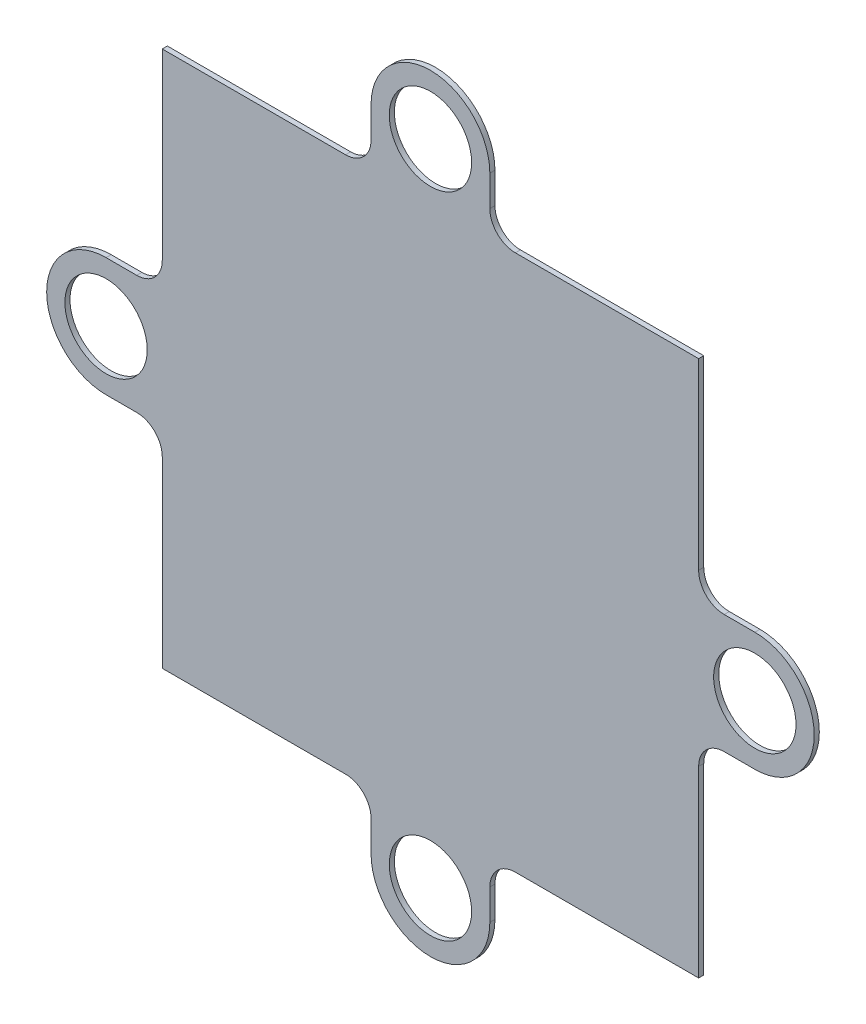
ISO-10303-21;
HEADER;
FILE_DESCRIPTION(('STEP AP214'),'2;1');
FILE_NAME('part.step','',(''),(''),'','','');
FILE_SCHEMA(('AUTOMOTIVE_DESIGN { 1 0 10303 214 1 1 1 1 }'));
ENDSEC;
DATA;
#1=APPLICATION_CONTEXT('core data for automotive mechanical design processes');
#2=APPLICATION_PROTOCOL_DEFINITION('international standard','automotive_design',2000,#1);
#3=PRODUCT_CONTEXT('',#1,'mechanical');
#4=PRODUCT('Part','Part','',(#3));
#5=PRODUCT_RELATED_PRODUCT_CATEGORY('part','',(#4));
#6=PRODUCT_DEFINITION_FORMATION('','',#4);
#7=PRODUCT_DEFINITION_CONTEXT('part definition',#1,'design');
#8=PRODUCT_DEFINITION('design','',#6,#7);
#9=PRODUCT_DEFINITION_SHAPE('','',#8);
#10=(LENGTH_UNIT() NAMED_UNIT(*) SI_UNIT(.MILLI.,.METRE.));
#11=(NAMED_UNIT(*) PLANE_ANGLE_UNIT() SI_UNIT($,.RADIAN.));
#12=(NAMED_UNIT(*) SI_UNIT($,.STERADIAN.) SOLID_ANGLE_UNIT());
#13=UNCERTAINTY_MEASURE_WITH_UNIT(LENGTH_MEASURE(1.E-05),#10,'distance_accuracy_value','');
#14=(GEOMETRIC_REPRESENTATION_CONTEXT(3) GLOBAL_UNCERTAINTY_ASSIGNED_CONTEXT((#13)) GLOBAL_UNIT_ASSIGNED_CONTEXT((#10,
#11,#12)) REPRESENTATION_CONTEXT('',''));
#15=CARTESIAN_POINT('',(0.,0.,0.));
#16=DIRECTION('',(0.,0.,1.));
#17=DIRECTION('',(1.,0.,0.));
#18=AXIS2_PLACEMENT_3D('',#15,#16,#17);
#19=CARTESIAN_POINT('',(0.,-4.64999999999974,0.4));
#20=DIRECTION('',(0.,1.,0.));
#21=DIRECTION('',(0.,0.,1.));
#22=AXIS2_PLACEMENT_3D('',#19,#20,#21);
#23=PLANE('',#22);
#24=DIRECTION('',(1.,0.,0.));
#25=VECTOR('',#24,1.);
#26=CARTESIAN_POINT('',(0.,-4.64999999999974,0.));
#27=LINE('',#26,#25);
#28=CARTESIAN_POINT('',(-25.4000000000001,-4.64999999999974,0.));
#29=VERTEX_POINT('',#28);
#30=CARTESIAN_POINT('',(-23.0000000000001,-4.64999999999974,0.));
#31=VERTEX_POINT('',#30);
#32=EDGE_CURVE('E282',#29,#31,#27,.T.);
#33=ORIENTED_EDGE('',*,*,#32,.T.);
#34=DIRECTION('',(0.,0.,-1.));
#35=VECTOR('',#34,1.);
#36=CARTESIAN_POINT('',(-23.0000000000001,-4.64999999999974,0.4));
#37=LINE('',#36,#35);
#38=CARTESIAN_POINT('',(-23.0000000000001,-4.64999999999974,0.4));
#39=VERTEX_POINT('',#38);
#40=EDGE_CURVE('E11',#39,#31,#37,.T.);
#41=ORIENTED_EDGE('',*,*,#40,.F.);
#42=DIRECTION('',(1.,0.,0.));
#43=VECTOR('',#42,1.);
#44=CARTESIAN_POINT('',(0.,-4.64999999999974,0.4));
#45=LINE('',#44,#43);
#46=CARTESIAN_POINT('',(-25.4000000000001,-4.64999999999974,0.4));
#47=VERTEX_POINT('',#46);
#48=EDGE_CURVE('E488',#47,#39,#45,.T.);
#49=ORIENTED_EDGE('',*,*,#48,.F.);
#50=DIRECTION('',(0.,0.,-1.));
#51=VECTOR('',#50,1.);
#52=CARTESIAN_POINT('',(-25.4000000000001,-4.64999999999974,0.4));
#53=LINE('',#52,#51);
#54=EDGE_CURVE('E262',#47,#29,#53,.T.);
#55=ORIENTED_EDGE('',*,*,#54,.T.);
#56=EDGE_LOOP('',(#33,#41,#49,#55));
#57=FACE_BOUND('',#56,.T.);
#58=ADVANCED_FACE('F45',(#57),#23,.F.);
#59=CARTESIAN_POINT('',(-23.0000000000001,-6.64999999999976,0.4));
#60=DIRECTION('',(0.,0.,-1.));
#61=DIRECTION('',(-1.,0.,0.));
#62=AXIS2_PLACEMENT_3D('',#59,#60,#61);
#63=CYLINDRICAL_SURFACE('',#62,2.00000000000001);
#64=CARTESIAN_POINT('',(-23.0000000000001,-6.64999999999976,0.));
#65=DIRECTION('',(0.,0.,1.));
#66=DIRECTION('',(1.,0.,0.));
#67=AXIS2_PLACEMENT_3D('',#64,#65,#66);
#68=CIRCLE('',#67,2.00000000000001);
#69=CARTESIAN_POINT('',(-21.0000000000001,-6.6499999999998,0.));
#70=VERTEX_POINT('',#69);
#71=EDGE_CURVE('E286',#31,#70,#68,.F.);
#72=ORIENTED_EDGE('',*,*,#71,.T.);
#73=DIRECTION('',(0.,0.,-1.));
#74=VECTOR('',#73,1.);
#75=CARTESIAN_POINT('',(-21.0000000000001,-6.6499999999998,0.4));
#76=LINE('',#75,#74);
#77=CARTESIAN_POINT('',(-21.0000000000001,-6.6499999999998,0.4));
#78=VERTEX_POINT('',#77);
#79=EDGE_CURVE('E55',#78,#70,#76,.T.);
#80=ORIENTED_EDGE('',*,*,#79,.F.);
#81=CARTESIAN_POINT('',(-23.0000000000001,-6.64999999999976,0.4));
#82=DIRECTION('',(0.,0.,1.));
#83=DIRECTION('',(1.,0.,0.));
#84=AXIS2_PLACEMENT_3D('',#81,#82,#83);
#85=CIRCLE('',#84,2.00000000000001);
#86=EDGE_CURVE('E162',#39,#78,#85,.F.);
#87=ORIENTED_EDGE('',*,*,#86,.F.);
#88=ORIENTED_EDGE('',*,*,#40,.T.);
#89=EDGE_LOOP('',(#72,#80,#87,#88));
#90=FACE_BOUND('',#89,.T.);
#91=ADVANCED_FACE('F468',(#90),#63,.F.);
#92=CARTESIAN_POINT('',(-21.0000000000001,-1.01544788837666E-13,0.4));
#93=DIRECTION('',(-1.,0.,0.));
#94=DIRECTION('',(0.,-1.,0.));
#95=AXIS2_PLACEMENT_3D('',#92,#93,#94);
#96=PLANE('',#95);
#97=DIRECTION('',(0.,1.,0.));
#98=VECTOR('',#97,1.);
#99=CARTESIAN_POINT('',(-21.0000000000001,-1.01544788837666E-13,0.));
#100=LINE('',#99,#98);
#101=CARTESIAN_POINT('',(-21.,-21.,0.));
#102=VERTEX_POINT('',#101);
#103=EDGE_CURVE('E290',#102,#70,#100,.T.);
#104=ORIENTED_EDGE('',*,*,#103,.F.);
#105=DIRECTION('',(0.,0.,-1.));
#106=VECTOR('',#105,1.);
#107=CARTESIAN_POINT('',(-21.,-21.,0.4));
#108=LINE('',#107,#106);
#109=CARTESIAN_POINT('',(-21.,-21.,0.4));
#110=VERTEX_POINT('',#109);
#111=EDGE_CURVE('E459',#110,#102,#108,.T.);
#112=ORIENTED_EDGE('',*,*,#111,.F.);
#113=DIRECTION('',(0.,1.,0.));
#114=VECTOR('',#113,1.);
#115=CARTESIAN_POINT('',(-21.0000000000001,-1.01544788837666E-13,0.4));
#116=LINE('',#115,#114);
#117=EDGE_CURVE('E467',#110,#78,#116,.T.);
#118=ORIENTED_EDGE('',*,*,#117,.T.);
#119=ORIENTED_EDGE('',*,*,#79,.T.);
#120=EDGE_LOOP('',(#104,#112,#118,#119));
#121=FACE_BOUND('',#120,.T.);
#122=ADVANCED_FACE('F465',(#121),#96,.T.);
#123=CARTESIAN_POINT('',(1.827806199078E-13,-20.9999999999998,0.4));
#124=DIRECTION('',(0.,1.,0.));
#125=DIRECTION('',(-1.,0.,0.));
#126=AXIS2_PLACEMENT_3D('',#123,#124,#125);
#127=PLANE('',#126);
#128=DIRECTION('',(1.,0.,0.));
#129=VECTOR('',#128,1.);
#130=CARTESIAN_POINT('',(1.827806199078E-13,-20.9999999999998,0.));
#131=LINE('',#130,#129);
#132=CARTESIAN_POINT('',(-6.65000000000012,-20.9999999999999,0.));
#133=VERTEX_POINT('',#132);
#134=EDGE_CURVE('E294',#102,#133,#131,.T.);
#135=ORIENTED_EDGE('',*,*,#134,.T.);
#136=DIRECTION('',(0.,0.,-1.));
#137=VECTOR('',#136,1.);
#138=CARTESIAN_POINT('',(-6.65000000000012,-20.9999999999999,0.4));
#139=LINE('',#138,#137);
#140=CARTESIAN_POINT('',(-6.65000000000012,-20.9999999999999,0.4));
#141=VERTEX_POINT('',#140);
#142=EDGE_CURVE('E456',#141,#133,#139,.T.);
#143=ORIENTED_EDGE('',*,*,#142,.F.);
#144=DIRECTION('',(1.,0.,0.));
#145=VECTOR('',#144,1.);
#146=CARTESIAN_POINT('',(1.827806199078E-13,-20.9999999999998,0.4));
#147=LINE('',#146,#145);
#148=EDGE_CURVE('E480',#110,#141,#147,.T.);
#149=ORIENTED_EDGE('',*,*,#148,.F.);
#150=ORIENTED_EDGE('',*,*,#111,.T.);
#151=EDGE_LOOP('',(#135,#143,#149,#150));
#152=FACE_BOUND('',#151,.T.);
#153=ADVANCED_FACE('F477',(#152),#127,.F.);
#154=CARTESIAN_POINT('',(-6.65000000000008,-22.9999999999999,0.4));
#155=DIRECTION('',(0.,0.,-1.));
#156=DIRECTION('',(-1.,0.,0.));
#157=AXIS2_PLACEMENT_3D('',#154,#155,#156);
#158=CYLINDRICAL_SURFACE('',#157,2.);
#159=CARTESIAN_POINT('',(-6.65000000000008,-22.9999999999999,0.));
#160=DIRECTION('',(0.,0.,1.));
#161=DIRECTION('',(1.,0.,0.));
#162=AXIS2_PLACEMENT_3D('',#159,#160,#161);
#163=CIRCLE('',#162,2.);
#164=CARTESIAN_POINT('',(-4.65000000000009,-22.9999999999999,0.));
#165=VERTEX_POINT('',#164);
#166=EDGE_CURVE('E298',#165,#133,#163,.T.);
#167=ORIENTED_EDGE('',*,*,#166,.F.);
#168=DIRECTION('',(0.,0.,-1.));
#169=VECTOR('',#168,1.);
#170=CARTESIAN_POINT('',(-4.65000000000009,-22.9999999999999,0.4));
#171=LINE('',#170,#169);
#172=CARTESIAN_POINT('',(-4.65000000000009,-22.9999999999999,0.4));
#173=VERTEX_POINT('',#172);
#174=EDGE_CURVE('E453',#173,#165,#171,.T.);
#175=ORIENTED_EDGE('',*,*,#174,.F.);
#176=CARTESIAN_POINT('',(-6.65000000000008,-22.9999999999999,0.4));
#177=DIRECTION('',(0.,0.,1.));
#178=DIRECTION('',(1.,0.,0.));
#179=AXIS2_PLACEMENT_3D('',#176,#177,#178);
#180=CIRCLE('',#179,2.);
#181=EDGE_CURVE('E483',#173,#141,#180,.T.);
#182=ORIENTED_EDGE('',*,*,#181,.T.);
#183=ORIENTED_EDGE('',*,*,#142,.T.);
#184=EDGE_LOOP('',(#167,#175,#182,#183));
#185=FACE_BOUND('',#184,.T.);
#186=ADVANCED_FACE('F841',(#185),#158,.F.);
#187=CARTESIAN_POINT('',(-4.65000000000009,0.,0.4));
#188=DIRECTION('',(-1.,0.,0.));
#189=DIRECTION('',(0.,0.,1.));
#190=AXIS2_PLACEMENT_3D('',#187,#188,#189);
#191=PLANE('',#190);
#192=DIRECTION('',(0.,1.,0.));
#193=VECTOR('',#192,1.);
#194=CARTESIAN_POINT('',(-4.65000000000009,0.,0.));
#195=LINE('',#194,#193);
#196=CARTESIAN_POINT('',(-4.65000000000009,-25.4,0.));
#197=VERTEX_POINT('',#196);
#198=EDGE_CURVE('E302',#197,#165,#195,.T.);
#199=ORIENTED_EDGE('',*,*,#198,.F.);
#200=DIRECTION('',(0.,0.,-1.));
#201=VECTOR('',#200,1.);
#202=CARTESIAN_POINT('',(-4.65000000000009,-25.4,0.4));
#203=LINE('',#202,#201);
#204=CARTESIAN_POINT('',(-4.65000000000009,-25.4,0.4));
#205=VERTEX_POINT('',#204);
#206=EDGE_CURVE('E450',#205,#197,#203,.T.);
#207=ORIENTED_EDGE('',*,*,#206,.F.);
#208=DIRECTION('',(0.,1.,0.));
#209=VECTOR('',#208,1.);
#210=CARTESIAN_POINT('',(-4.65000000000009,0.,0.4));
#211=LINE('',#210,#209);
#212=EDGE_CURVE('E494',#205,#173,#211,.T.);
#213=ORIENTED_EDGE('',*,*,#212,.T.);
#214=ORIENTED_EDGE('',*,*,#174,.T.);
#215=EDGE_LOOP('',(#199,#207,#213,#214));
#216=FACE_BOUND('',#215,.T.);
#217=ADVANCED_FACE('F832',(#216),#191,.T.);
#218=CARTESIAN_POINT('',(0.,-25.4,0.4));
#219=DIRECTION('',(0.,0.,-1.));
#220=DIRECTION('',(-1.,0.,0.));
#221=AXIS2_PLACEMENT_3D('',#218,#219,#220);
#222=CYLINDRICAL_SURFACE('',#221,4.65);
#223=CARTESIAN_POINT('',(0.,-25.4,0.));
#224=DIRECTION('',(0.,0.,1.));
#225=DIRECTION('',(1.,0.,0.));
#226=AXIS2_PLACEMENT_3D('',#223,#224,#225);
#227=CIRCLE('',#226,4.65);
#228=CARTESIAN_POINT('',(4.64999999999991,-25.4,0.));
#229=VERTEX_POINT('',#228);
#230=EDGE_CURVE('E306',#197,#229,#227,.T.);
#231=ORIENTED_EDGE('',*,*,#230,.T.);
#232=DIRECTION('',(0.,0.,-1.));
#233=VECTOR('',#232,1.);
#234=CARTESIAN_POINT('',(4.64999999999991,-25.4,0.4));
#235=LINE('',#234,#233);
#236=CARTESIAN_POINT('',(4.64999999999991,-25.4,0.4));
#237=VERTEX_POINT('',#236);
#238=EDGE_CURVE('E446',#237,#229,#235,.T.);
#239=ORIENTED_EDGE('',*,*,#238,.F.);
#240=CARTESIAN_POINT('',(0.,-25.4,0.4));
#241=DIRECTION('',(0.,0.,1.));
#242=DIRECTION('',(1.,0.,0.));
#243=AXIS2_PLACEMENT_3D('',#240,#241,#242);
#244=CIRCLE('',#243,4.65);
#245=EDGE_CURVE('E498',#205,#237,#244,.T.);
#246=ORIENTED_EDGE('',*,*,#245,.F.);
#247=ORIENTED_EDGE('',*,*,#206,.T.);
#248=EDGE_LOOP('',(#231,#239,#246,#247));
#249=FACE_BOUND('',#248,.T.);
#250=ADVANCED_FACE('F823',(#249),#222,.T.);
#251=CARTESIAN_POINT('',(4.64999999999991,0.,0.4));
#252=DIRECTION('',(-1.,0.,0.));
#253=DIRECTION('',(0.,0.,1.));
#254=AXIS2_PLACEMENT_3D('',#251,#252,#253);
#255=PLANE('',#254);
#256=DIRECTION('',(0.,1.,0.));
#257=VECTOR('',#256,1.);
#258=CARTESIAN_POINT('',(4.64999999999991,0.,0.));
#259=LINE('',#258,#257);
#260=CARTESIAN_POINT('',(4.64999999999991,-22.9999999999999,0.));
#261=VERTEX_POINT('',#260);
#262=EDGE_CURVE('E309',#229,#261,#259,.T.);
#263=ORIENTED_EDGE('',*,*,#262,.T.);
#264=DIRECTION('',(0.,0.,-1.));
#265=VECTOR('',#264,1.);
#266=CARTESIAN_POINT('',(4.64999999999991,-22.9999999999999,0.4));
#267=LINE('',#266,#265);
#268=CARTESIAN_POINT('',(4.64999999999991,-22.9999999999999,0.4));
#269=VERTEX_POINT('',#268);
#270=EDGE_CURVE('E442',#269,#261,#267,.T.);
#271=ORIENTED_EDGE('',*,*,#270,.F.);
#272=DIRECTION('',(0.,1.,0.));
#273=VECTOR('',#272,1.);
#274=CARTESIAN_POINT('',(4.64999999999991,0.,0.4));
#275=LINE('',#274,#273);
#276=EDGE_CURVE('E501',#237,#269,#275,.T.);
#277=ORIENTED_EDGE('',*,*,#276,.F.);
#278=ORIENTED_EDGE('',*,*,#238,.T.);
#279=EDGE_LOOP('',(#263,#271,#277,#278));
#280=FACE_BOUND('',#279,.T.);
#281=ADVANCED_FACE('F814',(#280),#255,.F.);
#282=CARTESIAN_POINT('',(6.6499999999999,-22.9999999999999,0.4));
#283=DIRECTION('',(0.,0.,-1.));
#284=DIRECTION('',(-1.,0.,0.));
#285=AXIS2_PLACEMENT_3D('',#282,#283,#284);
#286=CYLINDRICAL_SURFACE('',#285,2.);
#287=CARTESIAN_POINT('',(6.6499999999999,-22.9999999999999,0.));
#288=DIRECTION('',(0.,0.,1.));
#289=DIRECTION('',(1.,0.,0.));
#290=AXIS2_PLACEMENT_3D('',#287,#288,#289);
#291=CIRCLE('',#290,2.);
#292=CARTESIAN_POINT('',(6.64999999999994,-20.9999999999999,0.));
#293=VERTEX_POINT('',#292);
#294=EDGE_CURVE('E312',#261,#293,#291,.F.);
#295=ORIENTED_EDGE('',*,*,#294,.T.);
#296=DIRECTION('',(0.,0.,-1.));
#297=VECTOR('',#296,1.);
#298=CARTESIAN_POINT('',(6.64999999999994,-20.9999999999999,0.4));
#299=LINE('',#298,#297);
#300=CARTESIAN_POINT('',(6.64999999999994,-20.9999999999999,0.4));
#301=VERTEX_POINT('',#300);
#302=EDGE_CURVE('E438',#301,#293,#299,.T.);
#303=ORIENTED_EDGE('',*,*,#302,.F.);
#304=CARTESIAN_POINT('',(6.6499999999999,-22.9999999999999,0.4));
#305=DIRECTION('',(0.,0.,1.));
#306=DIRECTION('',(1.,0.,0.));
#307=AXIS2_PLACEMENT_3D('',#304,#305,#306);
#308=CIRCLE('',#307,2.);
#309=EDGE_CURVE('E504',#269,#301,#308,.F.);
#310=ORIENTED_EDGE('',*,*,#309,.F.);
#311=ORIENTED_EDGE('',*,*,#270,.T.);
#312=EDGE_LOOP('',(#295,#303,#310,#311));
#313=FACE_BOUND('',#312,.T.);
#314=ADVANCED_FACE('F805',(#313),#286,.F.);
#315=CARTESIAN_POINT('',(0.,-20.9999999999999,0.4));
#316=DIRECTION('',(0.,1.,0.));
#317=DIRECTION('',(0.,0.,1.));
#318=AXIS2_PLACEMENT_3D('',#315,#316,#317);
#319=PLANE('',#318);
#320=DIRECTION('',(1.,0.,0.));
#321=VECTOR('',#320,1.);
#322=CARTESIAN_POINT('',(0.,-20.9999999999999,0.));
#323=LINE('',#322,#321);
#324=CARTESIAN_POINT('',(21.,-21.,0.));
#325=VERTEX_POINT('',#324);
#326=EDGE_CURVE('E315',#293,#325,#323,.T.);
#327=ORIENTED_EDGE('',*,*,#326,.T.);
#328=DIRECTION('',(0.,0.,-1.));
#329=VECTOR('',#328,1.);
#330=CARTESIAN_POINT('',(21.,-21.,0.4));
#331=LINE('',#330,#329);
#332=CARTESIAN_POINT('',(21.,-21.,0.4));
#333=VERTEX_POINT('',#332);
#334=EDGE_CURVE('E434',#333,#325,#331,.T.);
#335=ORIENTED_EDGE('',*,*,#334,.F.);
#336=DIRECTION('',(1.,0.,0.));
#337=VECTOR('',#336,1.);
#338=CARTESIAN_POINT('',(0.,-20.9999999999999,0.4));
#339=LINE('',#338,#337);
#340=EDGE_CURVE('E507',#301,#333,#339,.T.);
#341=ORIENTED_EDGE('',*,*,#340,.F.);
#342=ORIENTED_EDGE('',*,*,#302,.T.);
#343=EDGE_LOOP('',(#327,#335,#341,#342));
#344=FACE_BOUND('',#343,.T.);
#345=ADVANCED_FACE('F796',(#344),#319,.F.);
#346=CARTESIAN_POINT('',(21.,0.,0.4));
#347=DIRECTION('',(-1.,0.,0.));
#348=DIRECTION('',(0.,-1.,0.));
#349=AXIS2_PLACEMENT_3D('',#346,#347,#348);
#350=PLANE('',#349);
#351=DIRECTION('',(0.,1.,0.));
#352=VECTOR('',#351,1.);
#353=CARTESIAN_POINT('',(21.,0.,0.));
#354=LINE('',#353,#352);
#355=CARTESIAN_POINT('',(21.,-6.6500000000001,0.));
#356=VERTEX_POINT('',#355);
#357=EDGE_CURVE('E318',#325,#356,#354,.T.);
#358=ORIENTED_EDGE('',*,*,#357,.T.);
#359=DIRECTION('',(0.,0.,-1.));
#360=VECTOR('',#359,1.);
#361=CARTESIAN_POINT('',(21.,-6.6500000000001,0.4));
#362=LINE('',#361,#360);
#363=CARTESIAN_POINT('',(21.,-6.6500000000001,0.4));
#364=VERTEX_POINT('',#363);
#365=EDGE_CURVE('E431',#364,#356,#362,.T.);
#366=ORIENTED_EDGE('',*,*,#365,.F.);
#367=DIRECTION('',(0.,1.,0.));
#368=VECTOR('',#367,1.);
#369=CARTESIAN_POINT('',(21.,0.,0.4));
#370=LINE('',#369,#368);
#371=EDGE_CURVE('E510',#333,#364,#370,.T.);
#372=ORIENTED_EDGE('',*,*,#371,.F.);
#373=ORIENTED_EDGE('',*,*,#334,.T.);
#374=EDGE_LOOP('',(#358,#366,#372,#373));
#375=FACE_BOUND('',#374,.T.);
#376=ADVANCED_FACE('F787',(#375),#350,.F.);
#377=CARTESIAN_POINT('',(23.,-6.65000000000009,0.4));
#378=DIRECTION('',(0.,0.,-1.));
#379=DIRECTION('',(-1.,0.,0.));
#380=AXIS2_PLACEMENT_3D('',#377,#378,#379);
#381=CYLINDRICAL_SURFACE('',#380,2.);
#382=CARTESIAN_POINT('',(23.,-6.65000000000009,0.));
#383=DIRECTION('',(0.,0.,1.));
#384=DIRECTION('',(1.,0.,0.));
#385=AXIS2_PLACEMENT_3D('',#382,#383,#384);
#386=CIRCLE('',#385,2.);
#387=CARTESIAN_POINT('',(23.,-4.6500000000001,0.));
#388=VERTEX_POINT('',#387);
#389=EDGE_CURVE('E322',#388,#356,#386,.T.);
#390=ORIENTED_EDGE('',*,*,#389,.F.);
#391=DIRECTION('',(0.,0.,-1.));
#392=VECTOR('',#391,1.);
#393=CARTESIAN_POINT('',(23.,-4.6500000000001,0.4));
#394=LINE('',#393,#392);
#395=CARTESIAN_POINT('',(23.,-4.6500000000001,0.4));
#396=VERTEX_POINT('',#395);
#397=EDGE_CURVE('E428',#396,#388,#394,.T.);
#398=ORIENTED_EDGE('',*,*,#397,.F.);
#399=CARTESIAN_POINT('',(23.,-6.65000000000009,0.4));
#400=DIRECTION('',(0.,0.,1.));
#401=DIRECTION('',(1.,0.,0.));
#402=AXIS2_PLACEMENT_3D('',#399,#400,#401);
#403=CIRCLE('',#402,2.);
#404=EDGE_CURVE('E513',#396,#364,#403,.T.);
#405=ORIENTED_EDGE('',*,*,#404,.T.);
#406=ORIENTED_EDGE('',*,*,#365,.T.);
#407=EDGE_LOOP('',(#390,#398,#405,#406));
#408=FACE_BOUND('',#407,.T.);
#409=ADVANCED_FACE('F778',(#408),#381,.F.);
#410=CARTESIAN_POINT('',(0.,-4.6500000000001,0.4));
#411=DIRECTION('',(0.,-1.,0.));
#412=DIRECTION('',(0.,0.,-1.));
#413=AXIS2_PLACEMENT_3D('',#410,#411,#412);
#414=PLANE('',#413);
#415=DIRECTION('',(-1.,0.,0.));
#416=VECTOR('',#415,1.);
#417=CARTESIAN_POINT('',(0.,-4.6500000000001,0.));
#418=LINE('',#417,#416);
#419=CARTESIAN_POINT('',(25.4000000000001,-4.6500000000001,0.));
#420=VERTEX_POINT('',#419);
#421=EDGE_CURVE('E326',#420,#388,#418,.T.);
#422=ORIENTED_EDGE('',*,*,#421,.F.);
#423=DIRECTION('',(0.,0.,-1.));
#424=VECTOR('',#423,1.);
#425=CARTESIAN_POINT('',(25.4000000000001,-4.6500000000001,0.4));
#426=LINE('',#425,#424);
#427=CARTESIAN_POINT('',(25.4000000000001,-4.6500000000001,0.4));
#428=VERTEX_POINT('',#427);
#429=EDGE_CURVE('E425',#428,#420,#426,.T.);
#430=ORIENTED_EDGE('',*,*,#429,.F.);
#431=DIRECTION('',(-1.,0.,0.));
#432=VECTOR('',#431,1.);
#433=CARTESIAN_POINT('',(0.,-4.6500000000001,0.4));
#434=LINE('',#433,#432);
#435=EDGE_CURVE('E517',#428,#396,#434,.T.);
#436=ORIENTED_EDGE('',*,*,#435,.T.);
#437=ORIENTED_EDGE('',*,*,#397,.T.);
#438=EDGE_LOOP('',(#422,#430,#436,#437));
#439=FACE_BOUND('',#438,.T.);
#440=ADVANCED_FACE('F769',(#439),#414,.T.);
#441=CARTESIAN_POINT('',(25.4000000000001,0.,0.4));
#442=DIRECTION('',(0.,0.,-1.));
#443=DIRECTION('',(-1.,0.,0.));
#444=AXIS2_PLACEMENT_3D('',#441,#442,#443);
#445=CYLINDRICAL_SURFACE('',#444,4.65);
#446=CARTESIAN_POINT('',(25.4000000000001,0.,0.));
#447=DIRECTION('',(0.,0.,1.));
#448=DIRECTION('',(1.,0.,0.));
#449=AXIS2_PLACEMENT_3D('',#446,#447,#448);
#450=CIRCLE('',#449,4.65);
#451=CARTESIAN_POINT('',(25.4000000000001,4.6499999999999,0.));
#452=VERTEX_POINT('',#451);
#453=EDGE_CURVE('E330',#420,#452,#450,.T.);
#454=ORIENTED_EDGE('',*,*,#453,.T.);
#455=DIRECTION('',(0.,0.,-1.));
#456=VECTOR('',#455,1.);
#457=CARTESIAN_POINT('',(25.4000000000001,4.6499999999999,0.4));
#458=LINE('',#457,#456);
#459=CARTESIAN_POINT('',(25.4000000000001,4.6499999999999,0.4));
#460=VERTEX_POINT('',#459);
#461=EDGE_CURVE('E421',#460,#452,#458,.T.);
#462=ORIENTED_EDGE('',*,*,#461,.F.);
#463=CARTESIAN_POINT('',(25.4000000000001,0.,0.4));
#464=DIRECTION('',(0.,0.,1.));
#465=DIRECTION('',(1.,0.,0.));
#466=AXIS2_PLACEMENT_3D('',#463,#464,#465);
#467=CIRCLE('',#466,4.65);
#468=EDGE_CURVE('E521',#428,#460,#467,.T.);
#469=ORIENTED_EDGE('',*,*,#468,.F.);
#470=ORIENTED_EDGE('',*,*,#429,.T.);
#471=EDGE_LOOP('',(#454,#462,#469,#470));
#472=FACE_BOUND('',#471,.T.);
#473=ADVANCED_FACE('F760',(#472),#445,.T.);
#474=CARTESIAN_POINT('',(0.,4.6499999999999,0.4));
#475=DIRECTION('',(0.,-1.,0.));
#476=DIRECTION('',(0.,0.,-1.));
#477=AXIS2_PLACEMENT_3D('',#474,#475,#476);
#478=PLANE('',#477);
#479=DIRECTION('',(-1.,0.,0.));
#480=VECTOR('',#479,1.);
#481=CARTESIAN_POINT('',(0.,4.6499999999999,0.));
#482=LINE('',#481,#480);
#483=CARTESIAN_POINT('',(23.,4.6499999999999,0.));
#484=VERTEX_POINT('',#483);
#485=EDGE_CURVE('E333',#452,#484,#482,.T.);
#486=ORIENTED_EDGE('',*,*,#485,.T.);
#487=DIRECTION('',(0.,0.,-1.));
#488=VECTOR('',#487,1.);
#489=CARTESIAN_POINT('',(23.,4.6499999999999,0.4));
#490=LINE('',#489,#488);
#491=CARTESIAN_POINT('',(23.,4.6499999999999,0.4));
#492=VERTEX_POINT('',#491);
#493=EDGE_CURVE('E417',#492,#484,#490,.T.);
#494=ORIENTED_EDGE('',*,*,#493,.F.);
#495=DIRECTION('',(-1.,0.,0.));
#496=VECTOR('',#495,1.);
#497=CARTESIAN_POINT('',(0.,4.6499999999999,0.4));
#498=LINE('',#497,#496);
#499=EDGE_CURVE('E524',#460,#492,#498,.T.);
#500=ORIENTED_EDGE('',*,*,#499,.F.);
#501=ORIENTED_EDGE('',*,*,#461,.T.);
#502=EDGE_LOOP('',(#486,#494,#500,#501));
#503=FACE_BOUND('',#502,.T.);
#504=ADVANCED_FACE('F751',(#503),#478,.F.);
#505=CARTESIAN_POINT('',(23.,6.64999999999991,0.4));
#506=DIRECTION('',(0.,0.,-1.));
#507=DIRECTION('',(-1.,0.,0.));
#508=AXIS2_PLACEMENT_3D('',#505,#506,#507);
#509=CYLINDRICAL_SURFACE('',#508,2.00000000000001);
#510=CARTESIAN_POINT('',(23.,6.64999999999991,0.));
#511=DIRECTION('',(0.,0.,1.));
#512=DIRECTION('',(1.,0.,0.));
#513=AXIS2_PLACEMENT_3D('',#510,#511,#512);
#514=CIRCLE('',#513,2.00000000000001);
#515=CARTESIAN_POINT('',(21.,6.64999999999993,0.));
#516=VERTEX_POINT('',#515);
#517=EDGE_CURVE('E336',#484,#516,#514,.F.);
#518=ORIENTED_EDGE('',*,*,#517,.T.);
#519=DIRECTION('',(0.,0.,-1.));
#520=VECTOR('',#519,1.);
#521=CARTESIAN_POINT('',(21.,6.64999999999993,0.4));
#522=LINE('',#521,#520);
#523=CARTESIAN_POINT('',(21.,6.64999999999993,0.4));
#524=VERTEX_POINT('',#523);
#525=EDGE_CURVE('E413',#524,#516,#522,.T.);
#526=ORIENTED_EDGE('',*,*,#525,.F.);
#527=CARTESIAN_POINT('',(23.,6.64999999999991,0.4));
#528=DIRECTION('',(0.,0.,1.));
#529=DIRECTION('',(1.,0.,0.));
#530=AXIS2_PLACEMENT_3D('',#527,#528,#529);
#531=CIRCLE('',#530,2.00000000000001);
#532=EDGE_CURVE('E527',#492,#524,#531,.F.);
#533=ORIENTED_EDGE('',*,*,#532,.F.);
#534=ORIENTED_EDGE('',*,*,#493,.T.);
#535=EDGE_LOOP('',(#518,#526,#533,#534));
#536=FACE_BOUND('',#535,.T.);
#537=ADVANCED_FACE('F742',(#536),#509,.F.);
#538=CARTESIAN_POINT('',(21.,0.,0.4));
#539=DIRECTION('',(-1.,0.,0.));
#540=DIRECTION('',(0.,0.,1.));
#541=AXIS2_PLACEMENT_3D('',#538,#539,#540);
#542=PLANE('',#541);
#543=DIRECTION('',(0.,1.,0.));
#544=VECTOR('',#543,1.);
#545=CARTESIAN_POINT('',(21.,0.,0.));
#546=LINE('',#545,#544);
#547=CARTESIAN_POINT('',(21.,21.,0.));
#548=VERTEX_POINT('',#547);
#549=EDGE_CURVE('E339',#516,#548,#546,.T.);
#550=ORIENTED_EDGE('',*,*,#549,.T.);
#551=DIRECTION('',(0.,0.,-1.));
#552=VECTOR('',#551,1.);
#553=CARTESIAN_POINT('',(21.,21.,0.4));
#554=LINE('',#553,#552);
#555=CARTESIAN_POINT('',(21.,21.,0.4));
#556=VERTEX_POINT('',#555);
#557=EDGE_CURVE('E410',#556,#548,#554,.T.);
#558=ORIENTED_EDGE('',*,*,#557,.F.);
#559=DIRECTION('',(0.,1.,0.));
#560=VECTOR('',#559,1.);
#561=CARTESIAN_POINT('',(21.,0.,0.4));
#562=LINE('',#561,#560);
#563=EDGE_CURVE('E530',#524,#556,#562,.T.);
#564=ORIENTED_EDGE('',*,*,#563,.F.);
#565=ORIENTED_EDGE('',*,*,#525,.T.);
#566=EDGE_LOOP('',(#550,#558,#564,#565));
#567=FACE_BOUND('',#566,.T.);
#568=ADVANCED_FACE('F733',(#567),#542,.F.);
#569=CARTESIAN_POINT('',(0.,21.,0.4));
#570=DIRECTION('',(0.,1.,0.));
#571=DIRECTION('',(0.,0.,1.));
#572=AXIS2_PLACEMENT_3D('',#569,#570,#571);
#573=PLANE('',#572);
#574=DIRECTION('',(1.,0.,0.));
#575=VECTOR('',#574,1.);
#576=CARTESIAN_POINT('',(0.,21.,0.));
#577=LINE('',#576,#575);
#578=CARTESIAN_POINT('',(6.65000000000001,21.,0.));
#579=VERTEX_POINT('',#578);
#580=EDGE_CURVE('E343',#579,#548,#577,.T.);
#581=ORIENTED_EDGE('',*,*,#580,.F.);
#582=DIRECTION('',(0.,0.,-1.));
#583=VECTOR('',#582,1.);
#584=CARTESIAN_POINT('',(6.65000000000001,21.,0.4));
#585=LINE('',#584,#583);
#586=CARTESIAN_POINT('',(6.65000000000001,21.,0.4));
#587=VERTEX_POINT('',#586);
#588=EDGE_CURVE('E407',#587,#579,#585,.T.);
#589=ORIENTED_EDGE('',*,*,#588,.F.);
#590=DIRECTION('',(1.,0.,0.));
#591=VECTOR('',#590,1.);
#592=CARTESIAN_POINT('',(0.,21.,0.4));
#593=LINE('',#592,#591);
#594=EDGE_CURVE('E533',#587,#556,#593,.T.);
#595=ORIENTED_EDGE('',*,*,#594,.T.);
#596=ORIENTED_EDGE('',*,*,#557,.T.);
#597=EDGE_LOOP('',(#581,#589,#595,#596));
#598=FACE_BOUND('',#597,.T.);
#599=ADVANCED_FACE('F724',(#598),#573,.T.);
#600=CARTESIAN_POINT('',(6.65000000000001,23.,0.4));
#601=DIRECTION('',(0.,0.,-1.));
#602=DIRECTION('',(-1.,0.,0.));
#603=AXIS2_PLACEMENT_3D('',#600,#601,#602);
#604=CYLINDRICAL_SURFACE('',#603,2.);
#605=CARTESIAN_POINT('',(6.65000000000001,23.,0.));
#606=DIRECTION('',(0.,0.,1.));
#607=DIRECTION('',(1.,0.,0.));
#608=AXIS2_PLACEMENT_3D('',#605,#606,#607);
#609=CIRCLE('',#608,2.);
#610=CARTESIAN_POINT('',(4.65,23.,0.));
#611=VERTEX_POINT('',#610);
#612=EDGE_CURVE('E347',#611,#579,#609,.T.);
#613=ORIENTED_EDGE('',*,*,#612,.F.);
#614=DIRECTION('',(0.,0.,-1.));
#615=VECTOR('',#614,1.);
#616=CARTESIAN_POINT('',(4.65,23.,0.4));
#617=LINE('',#616,#615);
#618=CARTESIAN_POINT('',(4.65,23.,0.4));
#619=VERTEX_POINT('',#618);
#620=EDGE_CURVE('E404',#619,#611,#617,.T.);
#621=ORIENTED_EDGE('',*,*,#620,.F.);
#622=CARTESIAN_POINT('',(6.65000000000001,23.,0.4));
#623=DIRECTION('',(0.,0.,1.));
#624=DIRECTION('',(1.,0.,0.));
#625=AXIS2_PLACEMENT_3D('',#622,#623,#624);
#626=CIRCLE('',#625,2.);
#627=EDGE_CURVE('E537',#619,#587,#626,.T.);
#628=ORIENTED_EDGE('',*,*,#627,.T.);
#629=ORIENTED_EDGE('',*,*,#588,.T.);
#630=EDGE_LOOP('',(#613,#621,#628,#629));
#631=FACE_BOUND('',#630,.T.);
#632=ADVANCED_FACE('F715',(#631),#604,.F.);
#633=CARTESIAN_POINT('',(4.65,0.,0.4));
#634=DIRECTION('',(1.,0.,0.));
#635=DIRECTION('',(0.,0.,-1.));
#636=AXIS2_PLACEMENT_3D('',#633,#634,#635);
#637=PLANE('',#636);
#638=DIRECTION('',(0.,-1.,0.));
#639=VECTOR('',#638,1.);
#640=CARTESIAN_POINT('',(4.65,0.,0.));
#641=LINE('',#640,#639);
#642=CARTESIAN_POINT('',(4.65,25.4000000000001,0.));
#643=VERTEX_POINT('',#642);
#644=EDGE_CURVE('E351',#643,#611,#641,.T.);
#645=ORIENTED_EDGE('',*,*,#644,.F.);
#646=DIRECTION('',(0.,0.,-1.));
#647=VECTOR('',#646,1.);
#648=CARTESIAN_POINT('',(4.65,25.4000000000001,0.4));
#649=LINE('',#648,#647);
#650=CARTESIAN_POINT('',(4.65,25.4000000000001,0.4));
#651=VERTEX_POINT('',#650);
#652=EDGE_CURVE('E401',#651,#643,#649,.T.);
#653=ORIENTED_EDGE('',*,*,#652,.F.);
#654=DIRECTION('',(0.,-1.,0.));
#655=VECTOR('',#654,1.);
#656=CARTESIAN_POINT('',(4.65,0.,0.4));
#657=LINE('',#656,#655);
#658=EDGE_CURVE('E541',#651,#619,#657,.T.);
#659=ORIENTED_EDGE('',*,*,#658,.T.);
#660=ORIENTED_EDGE('',*,*,#620,.T.);
#661=EDGE_LOOP('',(#645,#653,#659,#660));
#662=FACE_BOUND('',#661,.T.);
#663=ADVANCED_FACE('F706',(#662),#637,.T.);
#664=CARTESIAN_POINT('',(0.,25.4000000000001,0.4));
#665=DIRECTION('',(0.,0.,-1.));
#666=DIRECTION('',(-1.,0.,0.));
#667=AXIS2_PLACEMENT_3D('',#664,#665,#666);
#668=CYLINDRICAL_SURFACE('',#667,4.65);
#669=CARTESIAN_POINT('',(0.,25.4000000000001,0.));
#670=DIRECTION('',(0.,0.,1.));
#671=DIRECTION('',(1.,0.,0.));
#672=AXIS2_PLACEMENT_3D('',#669,#670,#671);
#673=CIRCLE('',#672,4.65);
#674=CARTESIAN_POINT('',(-4.65,25.4000000000001,0.));
#675=VERTEX_POINT('',#674);
#676=EDGE_CURVE('E355',#643,#675,#673,.T.);
#677=ORIENTED_EDGE('',*,*,#676,.T.);
#678=DIRECTION('',(0.,0.,-1.));
#679=VECTOR('',#678,1.);
#680=CARTESIAN_POINT('',(-4.65,25.4000000000001,0.4));
#681=LINE('',#680,#679);
#682=CARTESIAN_POINT('',(-4.65,25.4000000000001,0.4));
#683=VERTEX_POINT('',#682);
#684=EDGE_CURVE('E397',#683,#675,#681,.T.);
#685=ORIENTED_EDGE('',*,*,#684,.F.);
#686=CARTESIAN_POINT('',(0.,25.4000000000001,0.4));
#687=DIRECTION('',(0.,0.,1.));
#688=DIRECTION('',(1.,0.,0.));
#689=AXIS2_PLACEMENT_3D('',#686,#687,#688);
#690=CIRCLE('',#689,4.65);
#691=EDGE_CURVE('E545',#651,#683,#690,.T.);
#692=ORIENTED_EDGE('',*,*,#691,.F.);
#693=ORIENTED_EDGE('',*,*,#652,.T.);
#694=EDGE_LOOP('',(#677,#685,#692,#693));
#695=FACE_BOUND('',#694,.T.);
#696=ADVANCED_FACE('F697',(#695),#668,.T.);
#697=CARTESIAN_POINT('',(-4.65,0.,0.4));
#698=DIRECTION('',(1.,0.,0.));
#699=DIRECTION('',(0.,0.,-1.));
#700=AXIS2_PLACEMENT_3D('',#697,#698,#699);
#701=PLANE('',#700);
#702=DIRECTION('',(0.,-1.,0.));
#703=VECTOR('',#702,1.);
#704=CARTESIAN_POINT('',(-4.65,0.,0.));
#705=LINE('',#704,#703);
#706=CARTESIAN_POINT('',(-4.65,23.,0.));
#707=VERTEX_POINT('',#706);
#708=EDGE_CURVE('E358',#675,#707,#705,.T.);
#709=ORIENTED_EDGE('',*,*,#708,.T.);
#710=DIRECTION('',(0.,0.,-1.));
#711=VECTOR('',#710,1.);
#712=CARTESIAN_POINT('',(-4.65,23.,0.4));
#713=LINE('',#712,#711);
#714=CARTESIAN_POINT('',(-4.65,23.,0.4));
#715=VERTEX_POINT('',#714);
#716=EDGE_CURVE('E393',#715,#707,#713,.T.);
#717=ORIENTED_EDGE('',*,*,#716,.F.);
#718=DIRECTION('',(0.,-1.,0.));
#719=VECTOR('',#718,1.);
#720=CARTESIAN_POINT('',(-4.65,0.,0.4));
#721=LINE('',#720,#719);
#722=EDGE_CURVE('E548',#683,#715,#721,.T.);
#723=ORIENTED_EDGE('',*,*,#722,.F.);
#724=ORIENTED_EDGE('',*,*,#684,.T.);
#725=EDGE_LOOP('',(#709,#717,#723,#724));
#726=FACE_BOUND('',#725,.T.);
#727=ADVANCED_FACE('F688',(#726),#701,.F.);
#728=CARTESIAN_POINT('',(-6.65,23.,0.4));
#729=DIRECTION('',(0.,0.,-1.));
#730=DIRECTION('',(-1.,0.,0.));
#731=AXIS2_PLACEMENT_3D('',#728,#729,#730);
#732=CYLINDRICAL_SURFACE('',#731,2.);
#733=CARTESIAN_POINT('',(-6.65,23.,0.));
#734=DIRECTION('',(0.,0.,1.));
#735=DIRECTION('',(1.,0.,0.));
#736=AXIS2_PLACEMENT_3D('',#733,#734,#735);
#737=CIRCLE('',#736,2.);
#738=CARTESIAN_POINT('',(-6.65,21.,0.));
#739=VERTEX_POINT('',#738);
#740=EDGE_CURVE('E361',#707,#739,#737,.F.);
#741=ORIENTED_EDGE('',*,*,#740,.T.);
#742=DIRECTION('',(0.,0.,-1.));
#743=VECTOR('',#742,1.);
#744=CARTESIAN_POINT('',(-6.65,21.,0.4));
#745=LINE('',#744,#743);
#746=CARTESIAN_POINT('',(-6.65,21.,0.4));
#747=VERTEX_POINT('',#746);
#748=EDGE_CURVE('E390',#747,#739,#745,.T.);
#749=ORIENTED_EDGE('',*,*,#748,.F.);
#750=CARTESIAN_POINT('',(-6.65,23.,0.4));
#751=DIRECTION('',(0.,0.,1.));
#752=DIRECTION('',(1.,0.,0.));
#753=AXIS2_PLACEMENT_3D('',#750,#751,#752);
#754=CIRCLE('',#753,2.);
#755=EDGE_CURVE('E551',#715,#747,#754,.F.);
#756=ORIENTED_EDGE('',*,*,#755,.F.);
#757=ORIENTED_EDGE('',*,*,#716,.T.);
#758=EDGE_LOOP('',(#741,#749,#756,#757));
#759=FACE_BOUND('',#758,.T.);
#760=ADVANCED_FACE('F679',(#759),#732,.F.);
#761=CARTESIAN_POINT('',(0.,21.,0.4));
#762=DIRECTION('',(0.,1.,0.));
#763=DIRECTION('',(0.,0.,1.));
#764=AXIS2_PLACEMENT_3D('',#761,#762,#763);
#765=PLANE('',#764);
#766=DIRECTION('',(1.,0.,0.));
#767=VECTOR('',#766,1.);
#768=CARTESIAN_POINT('',(0.,21.,0.));
#769=LINE('',#768,#767);
#770=CARTESIAN_POINT('',(-21.,21.,0.));
#771=VERTEX_POINT('',#770);
#772=EDGE_CURVE('E365',#771,#739,#769,.T.);
#773=ORIENTED_EDGE('',*,*,#772,.F.);
#774=DIRECTION('',(0.,0.,-1.));
#775=VECTOR('',#774,1.);
#776=CARTESIAN_POINT('',(-21.,21.,0.4));
#777=LINE('',#776,#775);
#778=CARTESIAN_POINT('',(-21.,21.,0.4));
#779=VERTEX_POINT('',#778);
#780=EDGE_CURVE('E387',#779,#771,#777,.T.);
#781=ORIENTED_EDGE('',*,*,#780,.F.);
#782=DIRECTION('',(1.,0.,0.));
#783=VECTOR('',#782,1.);
#784=CARTESIAN_POINT('',(0.,21.,0.4));
#785=LINE('',#784,#783);
#786=EDGE_CURVE('E554',#779,#747,#785,.T.);
#787=ORIENTED_EDGE('',*,*,#786,.T.);
#788=ORIENTED_EDGE('',*,*,#748,.T.);
#789=EDGE_LOOP('',(#773,#781,#787,#788));
#790=FACE_BOUND('',#789,.T.);
#791=ADVANCED_FACE('F670',(#790),#765,.T.);
#792=CARTESIAN_POINT('',(-20.9999999999999,-1.01544788837668E-13,0.4));
#793=DIRECTION('',(-1.,0.,0.));
#794=DIRECTION('',(0.,-1.,0.));
#795=AXIS2_PLACEMENT_3D('',#792,#793,#794);
#796=PLANE('',#795);
#797=DIRECTION('',(0.,1.,0.));
#798=VECTOR('',#797,1.);
#799=CARTESIAN_POINT('',(-20.9999999999999,-1.01544788837668E-13,0.));
#800=LINE('',#799,#798);
#801=CARTESIAN_POINT('',(-20.9999999999999,6.65000000000023,0.));
#802=VERTEX_POINT('',#801);
#803=EDGE_CURVE('E369',#802,#771,#800,.T.);
#804=ORIENTED_EDGE('',*,*,#803,.F.);
#805=DIRECTION('',(0.,0.,-1.));
#806=VECTOR('',#805,1.);
#807=CARTESIAN_POINT('',(-20.9999999999999,6.65000000000023,0.4));
#808=LINE('',#807,#806);
#809=CARTESIAN_POINT('',(-20.9999999999999,6.65000000000023,0.4));
#810=VERTEX_POINT('',#809);
#811=EDGE_CURVE('E248',#810,#802,#808,.T.);
#812=ORIENTED_EDGE('',*,*,#811,.F.);
#813=DIRECTION('',(0.,1.,0.));
#814=VECTOR('',#813,1.);
#815=CARTESIAN_POINT('',(-20.9999999999999,-1.01544788837668E-13,0.4));
#816=LINE('',#815,#814);
#817=EDGE_CURVE('E255',#810,#779,#816,.T.);
#818=ORIENTED_EDGE('',*,*,#817,.T.);
#819=ORIENTED_EDGE('',*,*,#780,.T.);
#820=EDGE_LOOP('',(#804,#812,#818,#819));
#821=FACE_BOUND('',#820,.T.);
#822=ADVANCED_FACE('F560',(#821),#796,.T.);
#823=CARTESIAN_POINT('',(-22.9999999999999,6.65000000000024,0.4));
#824=DIRECTION('',(0.,0.,-1.));
#825=DIRECTION('',(-1.,0.,0.));
#826=AXIS2_PLACEMENT_3D('',#823,#824,#825);
#827=CYLINDRICAL_SURFACE('',#826,1.99999999999999);
#828=CARTESIAN_POINT('',(-22.9999999999999,6.65000000000024,0.));
#829=DIRECTION('',(0.,0.,1.));
#830=DIRECTION('',(1.,0.,0.));
#831=AXIS2_PLACEMENT_3D('',#828,#829,#830);
#832=CIRCLE('',#831,1.99999999999999);
#833=CARTESIAN_POINT('',(-22.9999999999999,4.65000000000026,0.));
#834=VERTEX_POINT('',#833);
#835=EDGE_CURVE('E242',#834,#802,#832,.T.);
#836=ORIENTED_EDGE('',*,*,#835,.F.);
#837=DIRECTION('',(0.,0.,-1.));
#838=VECTOR('',#837,1.);
#839=CARTESIAN_POINT('',(-22.9999999999999,4.65000000000026,0.4));
#840=LINE('',#839,#838);
#841=CARTESIAN_POINT('',(-22.9999999999999,4.65000000000026,0.4));
#842=VERTEX_POINT('',#841);
#843=EDGE_CURVE('E237',#842,#834,#840,.T.);
#844=ORIENTED_EDGE('',*,*,#843,.F.);
#845=CARTESIAN_POINT('',(-22.9999999999999,6.65000000000024,0.4));
#846=DIRECTION('',(0.,0.,1.));
#847=DIRECTION('',(1.,0.,0.));
#848=AXIS2_PLACEMENT_3D('',#845,#846,#847);
#849=CIRCLE('',#848,1.99999999999999);
#850=EDGE_CURVE('E240',#842,#810,#849,.T.);
#851=ORIENTED_EDGE('',*,*,#850,.T.);
#852=ORIENTED_EDGE('',*,*,#811,.T.);
#853=EDGE_LOOP('',(#836,#844,#851,#852));
#854=FACE_BOUND('',#853,.T.);
#855=ADVANCED_FACE('F239',(#854),#827,.F.);
#856=CARTESIAN_POINT('',(0.,4.65000000000026,0.4));
#857=DIRECTION('',(0.,1.,0.));
#858=DIRECTION('',(0.,0.,1.));
#859=AXIS2_PLACEMENT_3D('',#856,#857,#858);
#860=PLANE('',#859);
#861=DIRECTION('',(1.,0.,0.));
#862=VECTOR('',#861,1.);
#863=CARTESIAN_POINT('',(0.,4.65000000000026,0.));
#864=LINE('',#863,#862);
#865=CARTESIAN_POINT('',(-25.4000000000001,4.65000000000026,0.));
#866=VERTEX_POINT('',#865);
#867=EDGE_CURVE('E375',#866,#834,#864,.T.);
#868=ORIENTED_EDGE('',*,*,#867,.F.);
#869=DIRECTION('',(0.,0.,-1.));
#870=VECTOR('',#869,1.);
#871=CARTESIAN_POINT('',(-25.4000000000001,4.65000000000026,0.4));
#872=LINE('',#871,#870);
#873=CARTESIAN_POINT('',(-25.4000000000001,4.65000000000026,0.4));
#874=VERTEX_POINT('',#873);
#875=EDGE_CURVE('E151',#874,#866,#872,.T.);
#876=ORIENTED_EDGE('',*,*,#875,.F.);
#877=DIRECTION('',(1.,0.,0.));
#878=VECTOR('',#877,1.);
#879=CARTESIAN_POINT('',(0.,4.65000000000026,0.4));
#880=LINE('',#879,#878);
#881=EDGE_CURVE('E252',#874,#842,#880,.T.);
#882=ORIENTED_EDGE('',*,*,#881,.T.);
#883=ORIENTED_EDGE('',*,*,#843,.T.);
#884=EDGE_LOOP('',(#868,#876,#882,#883));
#885=FACE_BOUND('',#884,.T.);
#886=ADVANCED_FACE('F258',(#885),#860,.T.);
#887=CARTESIAN_POINT('',(-25.4000000000001,2.63677968348475E-13,0.4));
#888=DIRECTION('',(0.,0.,-1.));
#889=DIRECTION('',(-1.,0.,0.));
#890=AXIS2_PLACEMENT_3D('',#887,#888,#889);
#891=CYLINDRICAL_SURFACE('',#890,3.225);
#892=CARTESIAN_POINT('',(-25.4000000000001,2.63677968348475E-13,0.4));
#893=DIRECTION('',(0.,0.,1.));
#894=DIRECTION('',(1.,0.,0.));
#895=AXIS2_PLACEMENT_3D('',#892,#893,#894);
#896=CIRCLE('',#895,3.225);
#897=CARTESIAN_POINT('',(-22.1750000000001,2.63677968348475E-13,0.4));
#898=VERTEX_POINT('',#897);
#899=EDGE_CURVE('E977',#898,#898,#896,.T.);
#900=ORIENTED_EDGE('',*,*,#899,.T.);
#901=EDGE_LOOP('',(#900));
#902=FACE_BOUND('',#901,.T.);
#903=CARTESIAN_POINT('',(-25.4000000000001,2.63677968348475E-13,0.));
#904=DIRECTION('',(0.,0.,1.));
#905=DIRECTION('',(1.,0.,0.));
#906=AXIS2_PLACEMENT_3D('',#903,#904,#905);
#907=CIRCLE('',#906,3.225);
#908=CARTESIAN_POINT('',(-22.1750000000001,2.63677968348475E-13,0.));
#909=VERTEX_POINT('',#908);
#910=EDGE_CURVE('E278',#909,#909,#907,.T.);
#911=ORIENTED_EDGE('',*,*,#910,.F.);
#912=EDGE_LOOP('',(#911));
#913=FACE_BOUND('',#912,.T.);
#914=ADVANCED_FACE('F585',(#902,#913),#891,.F.);
#915=CARTESIAN_POINT('',(0.,-25.4,0.4));
#916=DIRECTION('',(0.,0.,-1.));
#917=DIRECTION('',(-1.,0.,0.));
#918=AXIS2_PLACEMENT_3D('',#915,#916,#917);
#919=CYLINDRICAL_SURFACE('',#918,3.22500000000011);
#920=CARTESIAN_POINT('',(0.,-25.4,0.4));
#921=DIRECTION('',(0.,0.,1.));
#922=DIRECTION('',(1.,0.,0.));
#923=AXIS2_PLACEMENT_3D('',#920,#921,#922);
#924=CIRCLE('',#923,3.22500000000011);
#925=CARTESIAN_POINT('',(3.22500000000002,-25.4,0.4));
#926=VERTEX_POINT('',#925);
#927=EDGE_CURVE('E972',#926,#926,#924,.T.);
#928=ORIENTED_EDGE('',*,*,#927,.T.);
#929=EDGE_LOOP('',(#928));
#930=FACE_BOUND('',#929,.T.);
#931=CARTESIAN_POINT('',(0.,-25.4,0.));
#932=DIRECTION('',(0.,0.,1.));
#933=DIRECTION('',(1.,0.,0.));
#934=AXIS2_PLACEMENT_3D('',#931,#932,#933);
#935=CIRCLE('',#934,3.22500000000011);
#936=CARTESIAN_POINT('',(3.22500000000002,-25.4,0.));
#937=VERTEX_POINT('',#936);
#938=EDGE_CURVE('E274',#937,#937,#935,.T.);
#939=ORIENTED_EDGE('',*,*,#938,.F.);
#940=EDGE_LOOP('',(#939));
#941=FACE_BOUND('',#940,.T.);
#942=ADVANCED_FACE('F588',(#930,#941),#919,.F.);
#943=CARTESIAN_POINT('',(25.4000000000001,0.,0.4));
#944=DIRECTION('',(0.,0.,-1.));
#945=DIRECTION('',(-1.,0.,0.));
#946=AXIS2_PLACEMENT_3D('',#943,#944,#945);
#947=CYLINDRICAL_SURFACE('',#946,3.225);
#948=CARTESIAN_POINT('',(25.4000000000001,0.,0.4));
#949=DIRECTION('',(0.,0.,1.));
#950=DIRECTION('',(1.,0.,0.));
#951=AXIS2_PLACEMENT_3D('',#948,#949,#950);
#952=CIRCLE('',#951,3.225);
#953=CARTESIAN_POINT('',(28.6250000000001,0.,0.4));
#954=VERTEX_POINT('',#953);
#955=EDGE_CURVE('E599',#954,#954,#952,.T.);
#956=ORIENTED_EDGE('',*,*,#955,.T.);
#957=EDGE_LOOP('',(#956));
#958=FACE_BOUND('',#957,.T.);
#959=CARTESIAN_POINT('',(25.4000000000001,0.,0.));
#960=DIRECTION('',(0.,0.,1.));
#961=DIRECTION('',(1.,0.,0.));
#962=AXIS2_PLACEMENT_3D('',#959,#960,#961);
#963=CIRCLE('',#962,3.225);
#964=CARTESIAN_POINT('',(28.6250000000001,0.,0.));
#965=VERTEX_POINT('',#964);
#966=EDGE_CURVE('E270',#965,#965,#963,.T.);
#967=ORIENTED_EDGE('',*,*,#966,.F.);
#968=EDGE_LOOP('',(#967));
#969=FACE_BOUND('',#968,.T.);
#970=ADVANCED_FACE('F573',(#958,#969),#947,.F.);
#971=CARTESIAN_POINT('',(0.,25.4000000000001,0.4));
#972=DIRECTION('',(0.,0.,-1.));
#973=DIRECTION('',(-1.,0.,0.));
#974=AXIS2_PLACEMENT_3D('',#971,#972,#973);
#975=CYLINDRICAL_SURFACE('',#974,3.225);
#976=CARTESIAN_POINT('',(0.,25.4000000000001,0.4));
#977=DIRECTION('',(0.,0.,1.));
#978=DIRECTION('',(1.,0.,0.));
#979=AXIS2_PLACEMENT_3D('',#976,#977,#978);
#980=CIRCLE('',#979,3.225);
#981=CARTESIAN_POINT('',(3.225,25.4000000000001,0.4));
#982=VERTEX_POINT('',#981);
#983=EDGE_CURVE('E380',#982,#982,#980,.T.);
#984=ORIENTED_EDGE('',*,*,#983,.T.);
#985=EDGE_LOOP('',(#984));
#986=FACE_BOUND('',#985,.T.);
#987=CARTESIAN_POINT('',(0.,25.4000000000001,0.));
#988=DIRECTION('',(0.,0.,1.));
#989=DIRECTION('',(1.,0.,0.));
#990=AXIS2_PLACEMENT_3D('',#987,#988,#989);
#991=CIRCLE('',#990,3.225);
#992=CARTESIAN_POINT('',(3.225,25.4000000000001,0.));
#993=VERTEX_POINT('',#992);
#994=EDGE_CURVE('E266',#993,#993,#991,.T.);
#995=ORIENTED_EDGE('',*,*,#994,.F.);
#996=EDGE_LOOP('',(#995));
#997=FACE_BOUND('',#996,.T.);
#998=ADVANCED_FACE('F47',(#986,#997),#975,.F.);
#999=CARTESIAN_POINT('',(-25.4000000000001,2.63677968348475E-13,0.4));
#1000=DIRECTION('',(0.,0.,-1.));
#1001=DIRECTION('',(-1.,0.,0.));
#1002=AXIS2_PLACEMENT_3D('',#999,#1000,#1001);
#1003=CYLINDRICAL_SURFACE('',#1002,4.65);
#1004=CARTESIAN_POINT('',(-25.4000000000001,2.63677968348475E-13,0.));
#1005=DIRECTION('',(0.,0.,1.));
#1006=DIRECTION('',(1.,0.,0.));
#1007=AXIS2_PLACEMENT_3D('',#1004,#1005,#1006);
#1008=CIRCLE('',#1007,4.65);
#1009=EDGE_CURVE('E154',#866,#29,#1008,.T.);
#1010=ORIENTED_EDGE('',*,*,#1009,.T.);
#1011=ORIENTED_EDGE('',*,*,#54,.F.);
#1012=CARTESIAN_POINT('',(-25.4000000000001,2.63677968348475E-13,0.4));
#1013=DIRECTION('',(0.,0.,1.));
#1014=DIRECTION('',(1.,0.,0.));
#1015=AXIS2_PLACEMENT_3D('',#1012,#1013,#1014);
#1016=CIRCLE('',#1015,4.65);
#1017=EDGE_CURVE('E63',#874,#47,#1016,.T.);
#1018=ORIENTED_EDGE('',*,*,#1017,.F.);
#1019=ORIENTED_EDGE('',*,*,#875,.T.);
#1020=EDGE_LOOP('',(#1010,#1011,#1018,#1019));
#1021=FACE_BOUND('',#1020,.T.);
#1022=ADVANCED_FACE('F564',(#1021),#1003,.T.);
#1023=CARTESIAN_POINT('',(0.,0.,0.4));
#1024=DIRECTION('',(0.,0.,1.));
#1025=DIRECTION('',(1.,0.,0.));
#1026=AXIS2_PLACEMENT_3D('',#1023,#1024,#1025);
#1027=PLANE('',#1026);
#1028=ORIENTED_EDGE('',*,*,#983,.F.);
#1029=EDGE_LOOP('',(#1028));
#1030=FACE_BOUND('',#1029,.T.);
#1031=ORIENTED_EDGE('',*,*,#955,.F.);
#1032=EDGE_LOOP('',(#1031));
#1033=FACE_BOUND('',#1032,.T.);
#1034=ORIENTED_EDGE('',*,*,#927,.F.);
#1035=EDGE_LOOP('',(#1034));
#1036=FACE_BOUND('',#1035,.T.);
#1037=ORIENTED_EDGE('',*,*,#899,.F.);
#1038=EDGE_LOOP('',(#1037));
#1039=FACE_BOUND('',#1038,.T.);
#1040=ORIENTED_EDGE('',*,*,#48,.T.);
#1041=ORIENTED_EDGE('',*,*,#86,.T.);
#1042=ORIENTED_EDGE('',*,*,#117,.F.);
#1043=ORIENTED_EDGE('',*,*,#148,.T.);
#1044=ORIENTED_EDGE('',*,*,#181,.F.);
#1045=ORIENTED_EDGE('',*,*,#212,.F.);
#1046=ORIENTED_EDGE('',*,*,#245,.T.);
#1047=ORIENTED_EDGE('',*,*,#276,.T.);
#1048=ORIENTED_EDGE('',*,*,#309,.T.);
#1049=ORIENTED_EDGE('',*,*,#340,.T.);
#1050=ORIENTED_EDGE('',*,*,#371,.T.);
#1051=ORIENTED_EDGE('',*,*,#404,.F.);
#1052=ORIENTED_EDGE('',*,*,#435,.F.);
#1053=ORIENTED_EDGE('',*,*,#468,.T.);
#1054=ORIENTED_EDGE('',*,*,#499,.T.);
#1055=ORIENTED_EDGE('',*,*,#532,.T.);
#1056=ORIENTED_EDGE('',*,*,#563,.T.);
#1057=ORIENTED_EDGE('',*,*,#594,.F.);
#1058=ORIENTED_EDGE('',*,*,#627,.F.);
#1059=ORIENTED_EDGE('',*,*,#658,.F.);
#1060=ORIENTED_EDGE('',*,*,#691,.T.);
#1061=ORIENTED_EDGE('',*,*,#722,.T.);
#1062=ORIENTED_EDGE('',*,*,#755,.T.);
#1063=ORIENTED_EDGE('',*,*,#786,.F.);
#1064=ORIENTED_EDGE('',*,*,#817,.F.);
#1065=ORIENTED_EDGE('',*,*,#850,.F.);
#1066=ORIENTED_EDGE('',*,*,#881,.F.);
#1067=ORIENTED_EDGE('',*,*,#1017,.T.);
#1068=EDGE_LOOP('',(#1040,#1041,#1042,#1043,#1044,#1045,#1046,#1047,#1048,#1049,#1050,#1051,
#1052,#1053,#1054,#1055,#1056,#1057,#1058,#1059,#1060,#1061,#1062,#1063,#1064,#1065,#1066,#1067));
#1069=FACE_BOUND('',#1068,.T.);
#1070=ADVANCED_FACE('F251',(#1030,#1033,#1036,#1039,#1069),#1027,.T.);
#1071=CARTESIAN_POINT('',(0.,0.,0.));
#1072=DIRECTION('',(0.,0.,1.));
#1073=DIRECTION('',(1.,0.,0.));
#1074=AXIS2_PLACEMENT_3D('',#1071,#1072,#1073);
#1075=PLANE('',#1074);
#1076=ORIENTED_EDGE('',*,*,#994,.T.);
#1077=EDGE_LOOP('',(#1076));
#1078=FACE_BOUND('',#1077,.T.);
#1079=ORIENTED_EDGE('',*,*,#966,.T.);
#1080=EDGE_LOOP('',(#1079));
#1081=FACE_BOUND('',#1080,.T.);
#1082=ORIENTED_EDGE('',*,*,#938,.T.);
#1083=EDGE_LOOP('',(#1082));
#1084=FACE_BOUND('',#1083,.T.);
#1085=ORIENTED_EDGE('',*,*,#910,.T.);
#1086=EDGE_LOOP('',(#1085));
#1087=FACE_BOUND('',#1086,.T.);
#1088=ORIENTED_EDGE('',*,*,#32,.F.);
#1089=ORIENTED_EDGE('',*,*,#1009,.F.);
#1090=ORIENTED_EDGE('',*,*,#867,.T.);
#1091=ORIENTED_EDGE('',*,*,#835,.T.);
#1092=ORIENTED_EDGE('',*,*,#803,.T.);
#1093=ORIENTED_EDGE('',*,*,#772,.T.);
#1094=ORIENTED_EDGE('',*,*,#740,.F.);
#1095=ORIENTED_EDGE('',*,*,#708,.F.);
#1096=ORIENTED_EDGE('',*,*,#676,.F.);
#1097=ORIENTED_EDGE('',*,*,#644,.T.);
#1098=ORIENTED_EDGE('',*,*,#612,.T.);
#1099=ORIENTED_EDGE('',*,*,#580,.T.);
#1100=ORIENTED_EDGE('',*,*,#549,.F.);
#1101=ORIENTED_EDGE('',*,*,#517,.F.);
#1102=ORIENTED_EDGE('',*,*,#485,.F.);
#1103=ORIENTED_EDGE('',*,*,#453,.F.);
#1104=ORIENTED_EDGE('',*,*,#421,.T.);
#1105=ORIENTED_EDGE('',*,*,#389,.T.);
#1106=ORIENTED_EDGE('',*,*,#357,.F.);
#1107=ORIENTED_EDGE('',*,*,#326,.F.);
#1108=ORIENTED_EDGE('',*,*,#294,.F.);
#1109=ORIENTED_EDGE('',*,*,#262,.F.);
#1110=ORIENTED_EDGE('',*,*,#230,.F.);
#1111=ORIENTED_EDGE('',*,*,#198,.T.);
#1112=ORIENTED_EDGE('',*,*,#166,.T.);
#1113=ORIENTED_EDGE('',*,*,#134,.F.);
#1114=ORIENTED_EDGE('',*,*,#103,.T.);
#1115=ORIENTED_EDGE('',*,*,#71,.F.);
#1116=EDGE_LOOP('',(#1088,#1089,#1090,#1091,#1092,#1093,#1094,#1095,#1096,#1097,#1098,#1099,
#1100,#1101,#1102,#1103,#1104,#1105,#1106,#1107,#1108,#1109,#1110,#1111,#1112,#1113,#1114,#1115));
#1117=FACE_BOUND('',#1116,.T.);
#1118=ADVANCED_FACE('F473',(#1078,#1081,#1084,#1087,#1117),#1075,.F.);
#1119=CLOSED_SHELL('',(#58,#91,#122,#153,#186,#217,#250,#281,#314,#345,#376,#409,#440,#473,#504,
#537,#568,#599,#632,#663,#696,#727,#760,#791,#822,#855,#886,#914,#942,#970,#998,#1022,#1070,#1118));
#1120=MANIFOLD_SOLID_BREP('B2',#1119);
#1121=ADVANCED_BREP_SHAPE_REPRESENTATION('',(#18,#1120),#14);
#1122=SHAPE_DEFINITION_REPRESENTATION(#9,#1121);
ENDSEC;
END-ISO-10303-21;
